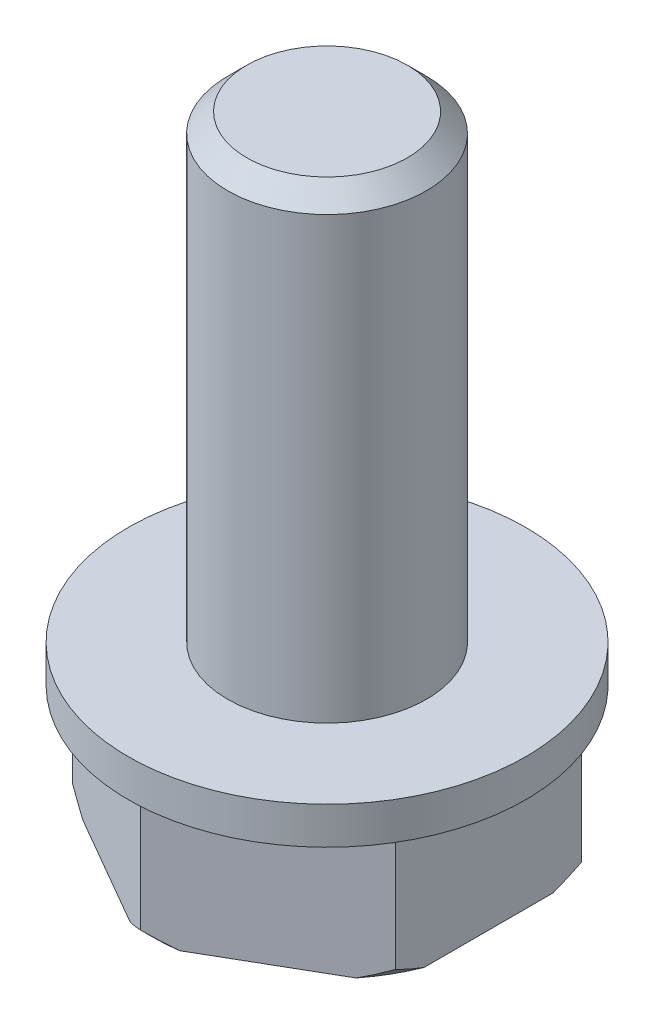
ISO-10303-21;
HEADER;
FILE_DESCRIPTION(('STEP AP214'),'2;1');
FILE_NAME('part.step','',(''),(''),'','','');
FILE_SCHEMA(('AUTOMOTIVE_DESIGN { 1 0 10303 214 1 1 1 1 }'));
ENDSEC;
DATA;
#1=APPLICATION_CONTEXT('core data for automotive mechanical design processes');
#2=APPLICATION_PROTOCOL_DEFINITION('international standard','automotive_design',2000,#1);
#3=PRODUCT_CONTEXT('',#1,'mechanical');
#4=PRODUCT('Part','Part','',(#3));
#5=PRODUCT_RELATED_PRODUCT_CATEGORY('part','',(#4));
#6=PRODUCT_DEFINITION_FORMATION('','',#4);
#7=PRODUCT_DEFINITION_CONTEXT('part definition',#1,'design');
#8=PRODUCT_DEFINITION('design','',#6,#7);
#9=PRODUCT_DEFINITION_SHAPE('','',#8);
#10=(LENGTH_UNIT() NAMED_UNIT(*) SI_UNIT(.MILLI.,.METRE.));
#11=(NAMED_UNIT(*) PLANE_ANGLE_UNIT() SI_UNIT($,.RADIAN.));
#12=(NAMED_UNIT(*) SI_UNIT($,.STERADIAN.) SOLID_ANGLE_UNIT());
#13=UNCERTAINTY_MEASURE_WITH_UNIT(LENGTH_MEASURE(1.E-05),#10,'distance_accuracy_value','');
#14=(GEOMETRIC_REPRESENTATION_CONTEXT(3) GLOBAL_UNCERTAINTY_ASSIGNED_CONTEXT((#13)) GLOBAL_UNIT_ASSIGNED_CONTEXT((#10,
#11,#12)) REPRESENTATION_CONTEXT('',''));
#15=CARTESIAN_POINT('',(0.,0.,0.));
#16=DIRECTION('',(0.,0.,1.));
#17=DIRECTION('',(1.,0.,0.));
#18=AXIS2_PLACEMENT_3D('',#15,#16,#17);
#19=CARTESIAN_POINT('',(31.2487373415292,113.4,-28.5015140912618));
#20=DIRECTION('',(-0.5,0.,0.866025403784439));
#21=DIRECTION('',(0.866025403784439,0.,0.5));
#22=AXIS2_PLACEMENT_3D('',#19,#20,#21);
#23=PLANE('',#22);
#24=DIRECTION('',(0.,-1.,0.));
#25=VECTOR('',#24,1.);
#26=CARTESIAN_POINT('',(31.2487373415292,113.4,-28.5015140912618));
#27=LINE('',#26,#25);
#28=CARTESIAN_POINT('',(31.2487373415292,68.7,-28.5015140912618));
#29=VERTEX_POINT('',#28);
#30=CARTESIAN_POINT('',(31.2487373415292,63.9055534994651,-28.5015140912618));
#31=VERTEX_POINT('',#30);
#32=EDGE_CURVE('E11',#29,#31,#27,.T.);
#33=ORIENTED_EDGE('',*,*,#32,.T.);
#34=CARTESIAN_POINT('',(30.2487373415292,63.4,-29.0788643604513));
#35=CARTESIAN_POINT('',(30.2898871786535,63.4176356350764,-29.0551063342587));
#36=CARTESIAN_POINT('',(30.3309185698522,63.4356367332046,-29.0314154590603));
#37=CARTESIAN_POINT('',(30.4131261080462,63.4725093452912,-28.9839491794677));
#38=CARTESIAN_POINT('',(30.4543000527066,63.491387396993,-28.9601750378369));
#39=CARTESIAN_POINT('',(30.5368134585381,63.5300136187559,-28.9125317923883));
#40=CARTESIAN_POINT('',(30.5781505543364,63.5497685285905,-28.8886640603468));
#41=CARTESIAN_POINT('',(30.6610101371074,63.5901483001101,-28.840822802906));
#42=CARTESIAN_POINT('',(30.7025301099427,63.6107800529027,-28.8168507420988));
#43=CARTESIAN_POINT('',(30.7857742143479,63.6529133663717,-28.7687901149625));
#44=CARTESIAN_POINT('',(30.8274956955541,63.6744219220571,-28.7447030936522));
#45=CARTESIAN_POINT('',(30.9111605932301,63.7183087773034,-28.6964018923307));
#46=CARTESIAN_POINT('',(30.9531012369611,63.7406941334488,-28.6721893240107));
#47=CARTESIAN_POINT('',(31.037221231282,63.7863344571394,-28.6236265656998));
#48=CARTESIAN_POINT('',(31.0793977002766,63.8095965033679,-28.5992780414191));
#49=CARTESIAN_POINT('',(31.164005290327,63.8569905234084,-28.5504330230577));
#50=CARTESIAN_POINT('',(31.2064334361144,63.8811295690813,-28.5259382351502));
#51=CARTESIAN_POINT('',(31.2487373415291,63.9055534994651,-28.5015140912617));
#52=B_SPLINE_CURVE_WITH_KNOTS('',3,(#34,#35,#36,#37,#38,#39,#40,#41,#42,#43,#44,#45,#46,#47,#48,
#49,#50,#51),.UNSPECIFIED.,.F.,.F.,(4,2,2,2,2,2,2,2,4),(0.,0.15204686609259,0.305507708751331,
0.460480357340252,0.617058082843112,0.775329645183761,0.935379361568319,1.0972871929665,
1.26112884592903),.UNSPECIFIED.);
#53=CARTESIAN_POINT('',(30.2487373415292,63.4,-29.0788643604513));
#54=VERTEX_POINT('',#53);
#55=EDGE_CURVE('E418',#54,#31,#52,.T.);
#56=ORIENTED_EDGE('',*,*,#55,.F.);
#57=DIRECTION('',(0.866025403784439,0.,0.5));
#58=VECTOR('',#57,1.);
#59=CARTESIAN_POINT('',(33.2487373415291,63.4,-27.3468135528825));
#60=LINE('',#59,#58);
#61=CARTESIAN_POINT('',(25.7487373415292,63.4,-31.6769405718047));
#62=VERTEX_POINT('',#61);
#63=EDGE_CURVE('E369',#62,#54,#60,.T.);
#64=ORIENTED_EDGE('',*,*,#63,.F.);
#65=CARTESIAN_POINT('',(24.7487373415291,63.9055534994651,-32.2542908409943));
#66=CARTESIAN_POINT('',(24.7910412233096,63.8811295690813,-32.2298666561701));
#67=CARTESIAN_POINT('',(24.8334684047916,63.8569905234084,-32.2053701980365));
#68=CARTESIAN_POINT('',(24.9180732265661,63.8095965033679,-32.1565203848805));
#69=CARTESIAN_POINT('',(24.9602479016351,63.7863344571393,-32.1321687534296));
#70=CARTESIAN_POINT('',(25.0443644811706,63.7406941334488,-32.083600080537));
#71=CARTESIAN_POINT('',(25.0863035022922,63.7183087773034,-32.0593847017748));
#72=CARTESIAN_POINT('',(25.1699660185079,63.674421922057,-32.0110793756431));
#73=CARTESIAN_POINT('',(25.2116867314672,63.6529133663717,-31.9869910236903));
#74=CARTESIAN_POINT('',(25.2949305076916,63.6107800529027,-31.9389298281282));
#75=CARTESIAN_POINT('',(25.3364509077494,63.5901483001101,-31.914958507292));
#76=CARTESIAN_POINT('',(25.4193124434277,63.5497685285904,-31.8671206323857));
#77=CARTESIAN_POINT('',(25.4606510536055,63.5300136187559,-31.8432555233265));
#78=CARTESIAN_POINT('',(25.5431680173984,63.4913873969929,-31.7956184404479));
#79=CARTESIAN_POINT('',(25.584344000334,63.4725093452912,-31.7718478292134));
#80=CARTESIAN_POINT('',(25.6665547733813,63.4356367332046,-31.7243871525511));
#81=CARTESIAN_POINT('',(25.7075873687404,63.4176356350764,-31.7006983630196));
#82=CARTESIAN_POINT('',(25.7487373415291,63.4,-31.6769405718047));
#83=B_SPLINE_CURVE_WITH_KNOTS('',3,(#65,#66,#67,#68,#69,#70,#71,#72,#73,#74,#75,#76,#77,#78,#79,
#80,#81,#82),.UNSPECIFIED.,.F.,.F.,(4,2,2,2,2,2,2,2,4),(0.,0.163841652962564,0.325749484360772,
0.485799200745352,0.644070763085999,0.800648488588859,0.955621137177764,1.10908197983649,
1.26112884592904),.UNSPECIFIED.);
#84=CARTESIAN_POINT('',(24.7487373415292,63.9055534994651,-32.2542908409943));
#85=VERTEX_POINT('',#84);
#86=EDGE_CURVE('E352',#85,#62,#83,.T.);
#87=ORIENTED_EDGE('',*,*,#86,.F.);
#88=DIRECTION('',(0.,-1.,0.));
#89=VECTOR('',#88,1.);
#90=CARTESIAN_POINT('',(24.7487373415292,113.4,-32.2542908409943));
#91=LINE('',#90,#89);
#92=CARTESIAN_POINT('',(24.7487373415292,68.7,-32.2542908409943));
#93=VERTEX_POINT('',#92);
#94=EDGE_CURVE('E355',#93,#85,#91,.T.);
#95=ORIENTED_EDGE('',*,*,#94,.F.);
#96=DIRECTION('',(-0.866025403784439,0.,-0.5));
#97=VECTOR('',#96,1.);
#98=CARTESIAN_POINT('',(30.9987373415292,68.7,-28.6458516585592));
#99=LINE('',#98,#97);
#100=EDGE_CURVE('E408',#29,#93,#99,.T.);
#101=ORIENTED_EDGE('',*,*,#100,.F.);
#102=EDGE_LOOP('',(#33,#56,#64,#87,#95,#101));
#103=FACE_BOUND('',#102,.T.);
#104=ADVANCED_FACE('F16',(#103),#23,.F.);
#105=CARTESIAN_POINT('',(31.2487373415292,113.4,-20.9959605917966));
#106=DIRECTION('',(-1.,0.,0.));
#107=DIRECTION('',(0.,0.,1.));
#108=AXIS2_PLACEMENT_3D('',#105,#106,#107);
#109=PLANE('',#108);
#110=DIRECTION('',(0.,-1.,0.));
#111=VECTOR('',#110,1.);
#112=CARTESIAN_POINT('',(31.2487373415292,113.4,-20.9959605917966));
#113=LINE('',#112,#111);
#114=CARTESIAN_POINT('',(31.2487373415292,68.7,-20.9959605917966));
#115=VERTEX_POINT('',#114);
#116=CARTESIAN_POINT('',(31.2487373415292,63.9055534994651,-20.9959605917966));
#117=VERTEX_POINT('',#116);
#118=EDGE_CURVE('E406',#115,#117,#113,.T.);
#119=ORIENTED_EDGE('',*,*,#118,.T.);
#120=CARTESIAN_POINT('',(31.2487373415291,63.4,-22.1506611301758));
#121=CARTESIAN_POINT('',(31.2487372058647,63.4176356350764,-22.1031453127683));
#122=CARTESIAN_POINT('',(31.2487360017043,63.4356367332046,-22.0557656480384));
#123=CARTESIAN_POINT('',(31.248732766851,63.4725093452911,-21.9608386917835));
#124=CARTESIAN_POINT('',(31.2487307285758,63.4913873969929,-21.9132939389182));
#125=CARTESIAN_POINT('',(31.2487271706144,63.5300136187559,-21.8180136105911));
#126=CARTESIAN_POINT('',(31.2487256562348,63.5497685285904,-21.7702807694904));
#127=CARTESIAN_POINT('',(31.2487237033276,63.5901483001101,-21.6746016371432));
#128=CARTESIAN_POINT('',(31.2487232761051,63.6107800529026,-21.6266582554998));
#129=CARTESIAN_POINT('',(31.2487236042859,63.6529133663716,-21.5305364328015));
#130=CARTESIAN_POINT('',(31.2487243725327,63.674421922057,-21.4823610595383));
#131=CARTESIAN_POINT('',(31.248726753993,63.7183087773034,-21.3857545320851));
#132=CARTESIAN_POINT('',(31.2487283766026,63.7406941334487,-21.3373265850029));
#133=CARTESIAN_POINT('',(31.2487317913879,63.7863344571393,-21.2401951537994));
#134=CARTESIAN_POINT('',(31.2487335853135,63.8095965033679,-21.1914949980678));
#135=CARTESIAN_POINT('',(31.2487363535894,63.8569905234084,-21.0938001665504));
#136=CARTESIAN_POINT('',(31.2487373178949,63.8811295690813,-21.0448089205093));
#137=CARTESIAN_POINT('',(31.2487373415291,63.9055534994651,-20.9959605917966));
#138=B_SPLINE_CURVE_WITH_KNOTS('',3,(#120,#121,#122,#123,#124,#125,#126,#127,#128,#129,#130,
#131,#132,#133,#134,#135,#136,#137),.UNSPECIFIED.,.F.,.F.,(4,2,2,2,2,2,2,2,4),(0.,
0.152046866092544,0.305507708751253,0.460480357340149,0.617058082843008,0.775329645183672,
0.935379361568252,1.09728719296647,1.26112884592905),.UNSPECIFIED.);
#139=CARTESIAN_POINT('',(31.2487373415292,63.4,-22.1506611301759));
#140=VERTEX_POINT('',#139);
#141=EDGE_CURVE('E29',#140,#117,#138,.T.);
#142=ORIENTED_EDGE('',*,*,#141,.F.);
#143=DIRECTION('',(0.,0.,1.));
#144=VECTOR('',#143,1.);
#145=CARTESIAN_POINT('',(31.2487373415292,63.4,-24.7487373415292));
#146=LINE('',#145,#144);
#147=CARTESIAN_POINT('',(31.2487373415292,63.4,-27.3468135528825));
#148=VERTEX_POINT('',#147);
#149=EDGE_CURVE('E445',#148,#140,#146,.T.);
#150=ORIENTED_EDGE('',*,*,#149,.F.);
#151=CARTESIAN_POINT('',(31.2487373415292,63.9055534994651,-28.5015140912618));
#152=CARTESIAN_POINT('',(31.2487373415292,63.7175987189877,-28.125604530307));
#153=CARTESIAN_POINT('',(31.2487373415292,63.5456736196058,-27.7393021691841));
#154=CARTESIAN_POINT('',(31.2487373415292,63.4,-27.3468135528825));
#155=(BOUNDED_CURVE() B_SPLINE_CURVE(3,(#151,#152,#153,#154),.UNSPECIFIED.,.F.,
.F.) B_SPLINE_CURVE_WITH_KNOTS((4,4),(0.00544471025563386,0.00669711306648936),
.UNSPECIFIED.) CURVE() GEOMETRIC_REPRESENTATION_ITEM() RATIONAL_B_SPLINE_CURVE((1.,1.,1.,1.)) REPRESENTATION_ITEM(''));
#156=EDGE_CURVE('E432',#31,#148,#155,.T.);
#157=ORIENTED_EDGE('',*,*,#156,.F.);
#158=ORIENTED_EDGE('',*,*,#32,.F.);
#159=DIRECTION('',(0.,0.,-1.));
#160=VECTOR('',#159,1.);
#161=CARTESIAN_POINT('',(31.2487373415292,68.7,-24.7487373415292));
#162=LINE('',#161,#160);
#163=EDGE_CURVE('E399',#115,#29,#162,.T.);
#164=ORIENTED_EDGE('',*,*,#163,.F.);
#165=EDGE_LOOP('',(#119,#142,#150,#157,#158,#164));
#166=FACE_BOUND('',#165,.T.);
#167=ADVANCED_FACE('F248',(#166),#109,.F.);
#168=CARTESIAN_POINT('',(24.7487373415292,64.2,-24.7487373415292));
#169=DIRECTION('',(0.,1.,0.));
#170=DIRECTION('',(0.,0.,1.));
#171=AXIS2_PLACEMENT_3D('',#168,#169,#170);
#172=CONICAL_SURFACE('',#171,7.8,0.785398163397448);
#173=CARTESIAN_POINT('',(24.7487373415292,63.4,-24.7487373415292));
#174=DIRECTION('',(0.,-1.,0.));
#175=DIRECTION('',(0.,0.,-1.));
#176=AXIS2_PLACEMENT_3D('',#173,#174,#175);
#177=CIRCLE('',#176,7.);
#178=CARTESIAN_POINT('',(30.2487373415292,63.4,-20.4186103226069));
#179=VERTEX_POINT('',#178);
#180=EDGE_CURVE('E131',#140,#179,#177,.T.);
#181=ORIENTED_EDGE('',*,*,#180,.F.);
#182=ORIENTED_EDGE('',*,*,#141,.T.);
#183=CARTESIAN_POINT('',(31.2487373415291,63.9055534994651,-20.9959605917966));
#184=CARTESIAN_POINT('',(31.2064334361144,63.8811295690813,-20.9715364479081));
#185=CARTESIAN_POINT('',(31.164005290327,63.8569905234084,-20.9470416600005));
#186=CARTESIAN_POINT('',(31.0793977002765,63.8095965033679,-20.8981966416391));
#187=CARTESIAN_POINT('',(31.0372212312819,63.7863344571393,-20.8738481173585));
#188=CARTESIAN_POINT('',(30.9531012369611,63.7406941334488,-20.8252853590476));
#189=CARTESIAN_POINT('',(30.91116059323,63.7183087773034,-20.8010727907276));
#190=CARTESIAN_POINT('',(30.827495695554,63.674421922057,-20.7527715894061));
#191=CARTESIAN_POINT('',(30.7857742143479,63.6529133663717,-20.7286845680957));
#192=CARTESIAN_POINT('',(30.7025301099427,63.6107800529026,-20.6806239409595));
#193=CARTESIAN_POINT('',(30.6610101371074,63.5901483001101,-20.6566518801522));
#194=CARTESIAN_POINT('',(30.5781505543363,63.5497685285904,-20.6088106227114));
#195=CARTESIAN_POINT('',(30.5368134585381,63.5300136187559,-20.5849428906699));
#196=CARTESIAN_POINT('',(30.4543000527066,63.4913873969929,-20.5372996452214));
#197=CARTESIAN_POINT('',(30.4131261080462,63.4725093452911,-20.5135255035906));
#198=CARTESIAN_POINT('',(30.3309185698522,63.4356367332046,-20.466059223998));
#199=CARTESIAN_POINT('',(30.2898871786534,63.4176356350764,-20.4423683487996));
#200=CARTESIAN_POINT('',(30.2487373415291,63.4,-20.418610322607));
#201=B_SPLINE_CURVE_WITH_KNOTS('',3,(#183,#184,#185,#186,#187,#188,#189,#190,#191,#192,#193,
#194,#195,#196,#197,#198,#199,#200),.UNSPECIFIED.,.F.,.F.,(4,2,2,2,2,2,2,2,4),(0.,
0.163841652962562,0.32574948436077,0.485799200745342,0.644070763086002,0.800648488588857,
0.955621137177764,1.10908197983648,1.26112884592903),.UNSPECIFIED.);
#202=EDGE_CURVE('E142',#117,#179,#201,.T.);
#203=ORIENTED_EDGE('',*,*,#202,.T.);
#204=EDGE_LOOP('',(#181,#182,#203));
#205=FACE_BOUND('',#204,.T.);
#206=ADVANCED_FACE('F237',(#205),#172,.T.);
#207=CARTESIAN_POINT('',(24.7487373415292,64.2,-24.7487373415292));
#208=DIRECTION('',(0.,1.,0.));
#209=DIRECTION('',(0.,0.,1.));
#210=AXIS2_PLACEMENT_3D('',#207,#208,#209);
#211=CONICAL_SURFACE('',#210,7.8,0.785398163397448);
#212=CARTESIAN_POINT('',(24.7487373415292,63.4,-24.7487373415292));
#213=DIRECTION('',(0.,-1.,0.));
#214=DIRECTION('',(0.,0.,-1.));
#215=AXIS2_PLACEMENT_3D('',#212,#213,#214);
#216=CIRCLE('',#215,7.);
#217=EDGE_CURVE('E372',#54,#148,#216,.T.);
#218=ORIENTED_EDGE('',*,*,#217,.F.);
#219=ORIENTED_EDGE('',*,*,#55,.T.);
#220=ORIENTED_EDGE('',*,*,#156,.T.);
#221=EDGE_LOOP('',(#218,#219,#220));
#222=FACE_BOUND('',#221,.T.);
#223=ADVANCED_FACE('F247',(#222),#211,.T.);
#224=CARTESIAN_POINT('',(24.7487373415292,64.2,-24.7487373415292));
#225=DIRECTION('',(0.,1.,0.));
#226=DIRECTION('',(0.,0.,1.));
#227=AXIS2_PLACEMENT_3D('',#224,#225,#226);
#228=CONICAL_SURFACE('',#227,7.8,0.785398163397448);
#229=CARTESIAN_POINT('',(24.7487373415292,63.4,-24.7487373415292));
#230=DIRECTION('',(0.,-1.,0.));
#231=DIRECTION('',(0.,0.,-1.));
#232=AXIS2_PLACEMENT_3D('',#229,#230,#231);
#233=CIRCLE('',#232,7.);
#234=CARTESIAN_POINT('',(23.7487373415292,63.4,-31.6769405718047));
#235=VERTEX_POINT('',#234);
#236=EDGE_CURVE('E367',#235,#62,#233,.T.);
#237=ORIENTED_EDGE('',*,*,#236,.F.);
#238=CARTESIAN_POINT('',(23.7487373415291,63.4,-31.6769405718047));
#239=CARTESIAN_POINT('',(23.7898873143179,63.4176356350764,-31.7006983630196));
#240=CARTESIAN_POINT('',(23.830919909677,63.4356367332046,-31.7243871525511));
#241=CARTESIAN_POINT('',(23.9131306827243,63.4725093452912,-31.7718478292134));
#242=CARTESIAN_POINT('',(23.9543066656599,63.4913873969929,-31.7956184404479));
#243=CARTESIAN_POINT('',(24.0368236294529,63.5300136187559,-31.8432555233265));
#244=CARTESIAN_POINT('',(24.0781622396307,63.5497685285904,-31.8671206323857));
#245=CARTESIAN_POINT('',(24.1610237753089,63.5901483001101,-31.914958507292));
#246=CARTESIAN_POINT('',(24.2025441753667,63.6107800529027,-31.9389298281282));
#247=CARTESIAN_POINT('',(24.2857879515911,63.6529133663717,-31.9869910236903));
#248=CARTESIAN_POINT('',(24.3275086645504,63.6744219220571,-32.0110793756431));
#249=CARTESIAN_POINT('',(24.4111711807662,63.7183087773034,-32.0593847017748));
#250=CARTESIAN_POINT('',(24.4531102018877,63.7406941334488,-32.083600080537));
#251=CARTESIAN_POINT('',(24.5372267814232,63.7863344571393,-32.1321687534296));
#252=CARTESIAN_POINT('',(24.5794014564922,63.8095965033679,-32.1565203848805));
#253=CARTESIAN_POINT('',(24.6640062782667,63.8569905234084,-32.2053701980365));
#254=CARTESIAN_POINT('',(24.7064334597487,63.8811295690813,-32.2298666561701));
#255=CARTESIAN_POINT('',(24.7487373415292,63.9055534994651,-32.2542908409943));
#256=B_SPLINE_CURVE_WITH_KNOTS('',3,(#238,#239,#240,#241,#242,#243,#244,#245,#246,#247,#248,
#249,#250,#251,#252,#253,#254,#255),.UNSPECIFIED.,.F.,.F.,(4,2,2,2,2,2,2,2,4),(0.,
0.152046866092578,0.305507708751304,0.460480357340222,0.617058082843082,0.77532964518374,
0.935379361568303,1.09728719296651,1.26112884592906),.UNSPECIFIED.);
#257=EDGE_CURVE('E351',#235,#85,#256,.T.);
#258=ORIENTED_EDGE('',*,*,#257,.T.);
#259=ORIENTED_EDGE('',*,*,#86,.T.);
#260=EDGE_LOOP('',(#237,#258,#259));
#261=FACE_BOUND('',#260,.T.);
#262=ADVANCED_FACE('F327',(#261),#228,.T.);
#263=CARTESIAN_POINT('',(24.7487373415292,70.2,-24.7487373415292));
#264=DIRECTION('',(0.,-1.,0.));
#265=DIRECTION('',(0.,0.,-1.));
#266=AXIS2_PLACEMENT_3D('',#263,#264,#265);
#267=PLANE('',#266);
#268=CARTESIAN_POINT('',(24.7487373415292,70.2,-24.7487373415292));
#269=DIRECTION('',(0.,-1.,0.));
#270=DIRECTION('',(0.,0.,-1.));
#271=AXIS2_PLACEMENT_3D('',#268,#269,#270);
#272=CIRCLE('',#271,4.);
#273=CARTESIAN_POINT('',(24.7487373415292,70.2,-28.7487373415292));
#274=VERTEX_POINT('',#273);
#275=EDGE_CURVE('E215',#274,#274,#272,.T.);
#276=ORIENTED_EDGE('',*,*,#275,.T.);
#277=EDGE_LOOP('',(#276));
#278=FACE_BOUND('',#277,.T.);
#279=CARTESIAN_POINT('',(24.7487373415292,70.2,-24.7487373415292));
#280=DIRECTION('',(0.,-1.,0.));
#281=DIRECTION('',(0.,0.,-1.));
#282=AXIS2_PLACEMENT_3D('',#279,#280,#281);
#283=CIRCLE('',#282,8.);
#284=CARTESIAN_POINT('',(24.7487373415292,70.2,-32.7487373415291));
#285=VERTEX_POINT('',#284);
#286=EDGE_CURVE('E350',#285,#285,#283,.T.);
#287=ORIENTED_EDGE('',*,*,#286,.F.);
#288=EDGE_LOOP('',(#287));
#289=FACE_BOUND('',#288,.T.);
#290=ADVANCED_FACE('F249',(#278,#289),#267,.F.);
#291=CARTESIAN_POINT('',(24.7487373415292,64.2,-24.7487373415292));
#292=DIRECTION('',(0.,1.,0.));
#293=DIRECTION('',(0.,0.,1.));
#294=AXIS2_PLACEMENT_3D('',#291,#292,#293);
#295=CONICAL_SURFACE('',#294,7.8,0.785398163397448);
#296=CARTESIAN_POINT('',(24.7487373415292,63.4,-24.7487373415292));
#297=DIRECTION('',(0.,-1.,0.));
#298=DIRECTION('',(0.,0.,-1.));
#299=AXIS2_PLACEMENT_3D('',#296,#297,#298);
#300=CIRCLE('',#299,7.);
#301=CARTESIAN_POINT('',(18.2487373415292,63.4,-27.3468135528825));
#302=VERTEX_POINT('',#301);
#303=CARTESIAN_POINT('',(19.2487373415291,63.4,-29.0788643604513));
#304=VERTEX_POINT('',#303);
#305=EDGE_CURVE('E374',#302,#304,#300,.T.);
#306=ORIENTED_EDGE('',*,*,#305,.F.);
#307=CARTESIAN_POINT('',(18.2487373415292,63.4,-27.3468135528825));
#308=CARTESIAN_POINT('',(18.2487374771936,63.4176356350764,-27.39432937029));
#309=CARTESIAN_POINT('',(18.248738681354,63.4356367332046,-27.4417090350199));
#310=CARTESIAN_POINT('',(18.2487419162073,63.4725093452912,-27.5366359912749));
#311=CARTESIAN_POINT('',(18.2487439544825,63.4913873969929,-27.5841807441401));
#312=CARTESIAN_POINT('',(18.2487475124439,63.5300136187559,-27.6794610724672));
#313=CARTESIAN_POINT('',(18.2487490268234,63.5497685285904,-27.727193913568));
#314=CARTESIAN_POINT('',(18.2487509797307,63.5901483001101,-27.8228730459151));
#315=CARTESIAN_POINT('',(18.2487514069532,63.6107800529027,-27.8708164275585));
#316=CARTESIAN_POINT('',(18.2487510787723,63.6529133663717,-27.9669382502568));
#317=CARTESIAN_POINT('',(18.2487503105256,63.674421922057,-28.01511362352));
#318=CARTESIAN_POINT('',(18.2487479290653,63.7183087773034,-28.1117201509732));
#319=CARTESIAN_POINT('',(18.2487463064557,63.7406941334488,-28.1601480980554));
#320=CARTESIAN_POINT('',(18.2487428916704,63.7863344571394,-28.2572795292589));
#321=CARTESIAN_POINT('',(18.2487410977448,63.8095965033679,-28.3059796849905));
#322=CARTESIAN_POINT('',(18.2487383294689,63.8569905234084,-28.4036745165079));
#323=CARTESIAN_POINT('',(18.2487373651634,63.8811295690813,-28.452665762549));
#324=CARTESIAN_POINT('',(18.2487373415292,63.9055534994651,-28.5015140912617));
#325=B_SPLINE_CURVE_WITH_KNOTS('',3,(#307,#308,#309,#310,#311,#312,#313,#314,#315,#316,#317,
#318,#319,#320,#321,#322,#323,#324),.UNSPECIFIED.,.F.,.F.,(4,2,2,2,2,2,2,2,4),(0.,
0.152046866092554,0.305507708751278,0.460480357340183,0.617058082843039,0.775329645183694,
0.935379361568264,1.09728719296648,1.26112884592904),.UNSPECIFIED.);
#326=CARTESIAN_POINT('',(18.2487373415292,63.9055534994651,-28.5015140912618));
#327=VERTEX_POINT('',#326);
#328=EDGE_CURVE('E312',#302,#327,#325,.T.);
#329=ORIENTED_EDGE('',*,*,#328,.T.);
#330=CARTESIAN_POINT('',(18.2487373415292,63.9055534994651,-28.5015140912617));
#331=CARTESIAN_POINT('',(18.2910412469439,63.8811295690813,-28.5259382351502));
#332=CARTESIAN_POINT('',(18.3334693927313,63.8569905234084,-28.5504330230578));
#333=CARTESIAN_POINT('',(18.4180769827818,63.8095965033679,-28.5992780414192));
#334=CARTESIAN_POINT('',(18.4602534517764,63.7863344571393,-28.6236265656998));
#335=CARTESIAN_POINT('',(18.5443734460972,63.7406941334488,-28.6721893240108));
#336=CARTESIAN_POINT('',(18.5863140898283,63.7183087773034,-28.6964018923307));
#337=CARTESIAN_POINT('',(18.6699789875043,63.674421922057,-28.7447030936522));
#338=CARTESIAN_POINT('',(18.7117004687104,63.6529133663717,-28.7687901149626));
#339=CARTESIAN_POINT('',(18.7949445731156,63.6107800529026,-28.8168507420988));
#340=CARTESIAN_POINT('',(18.8364645459509,63.5901483001101,-28.8408228029061));
#341=CARTESIAN_POINT('',(18.919324128722,63.5497685285904,-28.8886640603469));
#342=CARTESIAN_POINT('',(18.9606612245203,63.5300136187559,-28.9125317923884));
#343=CARTESIAN_POINT('',(19.0431746303517,63.4913873969929,-28.9601750378369));
#344=CARTESIAN_POINT('',(19.0843485750121,63.4725093452911,-28.9839491794677));
#345=CARTESIAN_POINT('',(19.1665561132061,63.4356367332046,-29.0314154590603));
#346=CARTESIAN_POINT('',(19.2075875044049,63.4176356350764,-29.0551063342587));
#347=CARTESIAN_POINT('',(19.2487373415292,63.4,-29.0788643604513));
#348=B_SPLINE_CURVE_WITH_KNOTS('',3,(#330,#331,#332,#333,#334,#335,#336,#337,#338,#339,#340,
#341,#342,#343,#344,#345,#346,#347),.UNSPECIFIED.,.F.,.F.,(4,2,2,2,2,2,2,2,4),(0.,
0.163841652962561,0.325749484360773,0.485799200745347,0.644070763086004,0.80064848858886,
0.955621137177767,1.10908197983648,1.26112884592904),.UNSPECIFIED.);
#349=EDGE_CURVE('E342',#327,#304,#348,.T.);
#350=ORIENTED_EDGE('',*,*,#349,.T.);
#351=EDGE_LOOP('',(#306,#329,#350));
#352=FACE_BOUND('',#351,.T.);
#353=ADVANCED_FACE('F318',(#352),#295,.T.);
#354=CARTESIAN_POINT('',(24.7487373415292,68.7,-24.7487373415292));
#355=DIRECTION('',(0.,-1.,0.));
#356=DIRECTION('',(0.,0.,-1.));
#357=AXIS2_PLACEMENT_3D('',#354,#355,#356);
#358=CYLINDRICAL_SURFACE('',#357,8.);
#359=ORIENTED_EDGE('',*,*,#286,.T.);
#360=EDGE_LOOP('',(#359));
#361=FACE_BOUND('',#360,.T.);
#362=CARTESIAN_POINT('',(24.7487373415292,68.7,-24.7487373415292));
#363=DIRECTION('',(0.,-1.,0.));
#364=DIRECTION('',(0.,0.,-1.));
#365=AXIS2_PLACEMENT_3D('',#362,#363,#364);
#366=CIRCLE('',#365,8.);
#367=CARTESIAN_POINT('',(24.7487373415292,68.7,-32.7487373415291));
#368=VERTEX_POINT('',#367);
#369=EDGE_CURVE('E390',#368,#368,#366,.T.);
#370=ORIENTED_EDGE('',*,*,#369,.F.);
#371=EDGE_LOOP('',(#370));
#372=FACE_BOUND('',#371,.T.);
#373=ADVANCED_FACE('F288',(#361,#372),#358,.T.);
#374=CARTESIAN_POINT('',(24.7487373415292,113.4,-32.2542908409943));
#375=DIRECTION('',(0.5,0.,0.866025403784439));
#376=DIRECTION('',(0.866025403784439,0.,-0.5));
#377=AXIS2_PLACEMENT_3D('',#374,#375,#376);
#378=PLANE('',#377);
#379=ORIENTED_EDGE('',*,*,#94,.T.);
#380=ORIENTED_EDGE('',*,*,#257,.F.);
#381=DIRECTION('',(0.866025403784439,0.,-0.5));
#382=VECTOR('',#381,1.);
#383=CARTESIAN_POINT('',(26.7487373415292,63.4,-33.4089913793736));
#384=LINE('',#383,#382);
#385=EDGE_CURVE('E348',#304,#235,#384,.T.);
#386=ORIENTED_EDGE('',*,*,#385,.F.);
#387=ORIENTED_EDGE('',*,*,#349,.F.);
#388=DIRECTION('',(0.,-1.,0.));
#389=VECTOR('',#388,1.);
#390=CARTESIAN_POINT('',(18.2487373415292,113.4,-28.5015140912618));
#391=LINE('',#390,#389);
#392=CARTESIAN_POINT('',(18.2487373415292,68.7,-28.5015140912618));
#393=VERTEX_POINT('',#392);
#394=EDGE_CURVE('E345',#393,#327,#391,.T.);
#395=ORIENTED_EDGE('',*,*,#394,.F.);
#396=DIRECTION('',(-0.866025403784439,0.,0.5));
#397=VECTOR('',#396,1.);
#398=CARTESIAN_POINT('',(24.4987373415292,68.7,-32.1099532736969));
#399=LINE('',#398,#397);
#400=EDGE_CURVE('E396',#93,#393,#399,.T.);
#401=ORIENTED_EDGE('',*,*,#400,.F.);
#402=EDGE_LOOP('',(#379,#380,#386,#387,#395,#401));
#403=FACE_BOUND('',#402,.T.);
#404=ADVANCED_FACE('F284',(#403),#378,.F.);
#405=CARTESIAN_POINT('',(18.2487373415292,113.4,-28.5015140912618));
#406=DIRECTION('',(1.,0.,0.));
#407=DIRECTION('',(0.,0.,-1.));
#408=AXIS2_PLACEMENT_3D('',#405,#406,#407);
#409=PLANE('',#408);
#410=ORIENTED_EDGE('',*,*,#394,.T.);
#411=ORIENTED_EDGE('',*,*,#328,.F.);
#412=DIRECTION('',(0.,0.,-1.));
#413=VECTOR('',#412,1.);
#414=CARTESIAN_POINT('',(18.2487373415292,63.4,-24.7487373415292));
#415=LINE('',#414,#413);
#416=CARTESIAN_POINT('',(18.2487373415292,63.4,-22.1506611301759));
#417=VERTEX_POINT('',#416);
#418=EDGE_CURVE('E210',#417,#302,#415,.T.);
#419=ORIENTED_EDGE('',*,*,#418,.F.);
#420=CARTESIAN_POINT('',(18.2487373415292,63.9055534994651,-20.9959605917966));
#421=CARTESIAN_POINT('',(18.2487373415292,63.7175987189877,-21.3718701527514));
#422=CARTESIAN_POINT('',(18.2487373415292,63.5456736196058,-21.7581725138741));
#423=CARTESIAN_POINT('',(18.2487373415292,63.4,-22.1506611301759));
#424=(BOUNDED_CURVE() B_SPLINE_CURVE(3,(#420,#421,#422,#423),.UNSPECIFIED.,.F.,
.F.) B_SPLINE_CURVE_WITH_KNOTS((4,4),(0.00544471025563386,0.00669711306648936),
.UNSPECIFIED.) CURVE() GEOMETRIC_REPRESENTATION_ITEM() RATIONAL_B_SPLINE_CURVE((1.,1.,1.,1.)) REPRESENTATION_ITEM(''));
#425=CARTESIAN_POINT('',(18.2487373415292,63.9055534994651,-20.9959605917966));
#426=VERTEX_POINT('',#425);
#427=EDGE_CURVE('E130',#426,#417,#424,.T.);
#428=ORIENTED_EDGE('',*,*,#427,.F.);
#429=DIRECTION('',(0.,-1.,0.));
#430=VECTOR('',#429,1.);
#431=CARTESIAN_POINT('',(18.2487373415292,113.4,-20.9959605917966));
#432=LINE('',#431,#430);
#433=CARTESIAN_POINT('',(18.2487373415292,68.7,-20.9959605917966));
#434=VERTEX_POINT('',#433);
#435=EDGE_CURVE('E220',#434,#426,#432,.T.);
#436=ORIENTED_EDGE('',*,*,#435,.F.);
#437=DIRECTION('',(0.,0.,1.));
#438=VECTOR('',#437,1.);
#439=CARTESIAN_POINT('',(18.2487373415292,68.7,-24.7487373415292));
#440=LINE('',#439,#438);
#441=EDGE_CURVE('E392',#393,#434,#440,.T.);
#442=ORIENTED_EDGE('',*,*,#441,.F.);
#443=EDGE_LOOP('',(#410,#411,#419,#428,#436,#442));
#444=FACE_BOUND('',#443,.T.);
#445=ADVANCED_FACE('F18',(#444),#409,.F.);
#446=CARTESIAN_POINT('',(32.7487373415291,68.7,-24.7487373415292));
#447=DIRECTION('',(0.,1.,0.));
#448=DIRECTION('',(0.,0.,1.));
#449=AXIS2_PLACEMENT_3D('',#446,#447,#448);
#450=PLANE('',#449);
#451=ORIENTED_EDGE('',*,*,#369,.T.);
#452=EDGE_LOOP('',(#451));
#453=FACE_BOUND('',#452,.T.);
#454=ORIENTED_EDGE('',*,*,#163,.T.);
#455=ORIENTED_EDGE('',*,*,#100,.T.);
#456=ORIENTED_EDGE('',*,*,#400,.T.);
#457=ORIENTED_EDGE('',*,*,#441,.T.);
#458=DIRECTION('',(0.866025403784439,0.,0.5));
#459=VECTOR('',#458,1.);
#460=CARTESIAN_POINT('',(24.4987373415292,68.7,-17.3875214093615));
#461=LINE('',#460,#459);
#462=CARTESIAN_POINT('',(24.7487373415292,68.7,-17.243183842064));
#463=VERTEX_POINT('',#462);
#464=EDGE_CURVE('E211',#434,#463,#461,.T.);
#465=ORIENTED_EDGE('',*,*,#464,.T.);
#466=DIRECTION('',(0.866025403784439,0.,-0.5));
#467=VECTOR('',#466,1.);
#468=CARTESIAN_POINT('',(30.9987373415292,68.7,-20.8516230244992));
#469=LINE('',#468,#467);
#470=EDGE_CURVE('E227',#463,#115,#469,.T.);
#471=ORIENTED_EDGE('',*,*,#470,.T.);
#472=EDGE_LOOP('',(#454,#455,#456,#457,#465,#471));
#473=FACE_BOUND('',#472,.T.);
#474=ADVANCED_FACE('F282',(#453,#473),#450,.F.);
#475=CARTESIAN_POINT('',(24.7487373415292,88.7,-24.7487373415292));
#476=DIRECTION('',(0.,-1.,0.));
#477=DIRECTION('',(0.,0.,-1.));
#478=AXIS2_PLACEMENT_3D('',#475,#476,#477);
#479=CONICAL_SURFACE('',#478,3.233,0.78539816339745);
#480=CARTESIAN_POINT('',(24.7487373415292,88.7,-24.7487373415292));
#481=DIRECTION('',(0.,-1.,0.));
#482=DIRECTION('',(0.,0.,-1.));
#483=AXIS2_PLACEMENT_3D('',#480,#481,#482);
#484=CIRCLE('',#483,3.233);
#485=CARTESIAN_POINT('',(24.7487373415292,88.7,-27.9817373415292));
#486=VERTEX_POINT('',#485);
#487=EDGE_CURVE('E403',#486,#486,#484,.T.);
#488=ORIENTED_EDGE('',*,*,#487,.T.);
#489=EDGE_LOOP('',(#488));
#490=FACE_BOUND('',#489,.T.);
#491=CARTESIAN_POINT('',(24.7487373415292,87.933,-24.7487373415292));
#492=DIRECTION('',(0.,-1.,0.));
#493=DIRECTION('',(0.,0.,-1.));
#494=AXIS2_PLACEMENT_3D('',#491,#492,#493);
#495=CIRCLE('',#494,4.);
#496=CARTESIAN_POINT('',(24.7487373415292,87.933,-28.7487373415292));
#497=VERTEX_POINT('',#496);
#498=EDGE_CURVE('E401',#497,#497,#495,.T.);
#499=ORIENTED_EDGE('',*,*,#498,.F.);
#500=EDGE_LOOP('',(#499));
#501=FACE_BOUND('',#500,.T.);
#502=ADVANCED_FACE('F279',(#490,#501),#479,.T.);
#503=CARTESIAN_POINT('',(24.7487373415292,88.7,-24.7487373415292));
#504=DIRECTION('',(0.,-1.,0.));
#505=DIRECTION('',(0.,0.,-1.));
#506=AXIS2_PLACEMENT_3D('',#503,#504,#505);
#507=PLANE('',#506);
#508=ORIENTED_EDGE('',*,*,#487,.F.);
#509=EDGE_LOOP('',(#508));
#510=FACE_BOUND('',#509,.T.);
#511=ADVANCED_FACE('F163',(#510),#507,.F.);
#512=CARTESIAN_POINT('',(24.7487373415292,63.4,-24.7487373415292));
#513=DIRECTION('',(0.,-1.,0.));
#514=DIRECTION('',(0.,0.,-1.));
#515=AXIS2_PLACEMENT_3D('',#512,#513,#514);
#516=CYLINDRICAL_SURFACE('',#515,4.);
#517=ORIENTED_EDGE('',*,*,#498,.T.);
#518=EDGE_LOOP('',(#517));
#519=FACE_BOUND('',#518,.T.);
#520=ORIENTED_EDGE('',*,*,#275,.F.);
#521=EDGE_LOOP('',(#520));
#522=FACE_BOUND('',#521,.T.);
#523=ADVANCED_FACE('F162',(#519,#522),#516,.T.);
#524=CARTESIAN_POINT('',(24.7487373415292,64.2,-24.7487373415292));
#525=DIRECTION('',(0.,1.,0.));
#526=DIRECTION('',(0.,0.,1.));
#527=AXIS2_PLACEMENT_3D('',#524,#525,#526);
#528=CONICAL_SURFACE('',#527,7.8,0.785398163397448);
#529=CARTESIAN_POINT('',(24.7487373415292,63.4,-24.7487373415292));
#530=DIRECTION('',(0.,-1.,0.));
#531=DIRECTION('',(0.,0.,-1.));
#532=AXIS2_PLACEMENT_3D('',#529,#530,#531);
#533=CIRCLE('',#532,7.);
#534=CARTESIAN_POINT('',(25.7487373415292,63.4,-17.8205341112537));
#535=VERTEX_POINT('',#534);
#536=CARTESIAN_POINT('',(23.7487373415292,63.4,-17.8205341112537));
#537=VERTEX_POINT('',#536);
#538=EDGE_CURVE('E118',#535,#537,#533,.T.);
#539=ORIENTED_EDGE('',*,*,#538,.F.);
#540=CARTESIAN_POINT('',(25.7487373415292,63.4,-17.8205341112537));
#541=CARTESIAN_POINT('',(25.7075873687404,63.4176356350764,-17.7967763200387));
#542=CARTESIAN_POINT('',(25.6665547733813,63.4356367332046,-17.7730875305072));
#543=CARTESIAN_POINT('',(25.5843440003339,63.4725093452912,-17.7256268538449));
#544=CARTESIAN_POINT('',(25.5431680173983,63.4913873969929,-17.7018562426104));
#545=CARTESIAN_POINT('',(25.4606510536054,63.5300136187559,-17.6542191597318));
#546=CARTESIAN_POINT('',(25.4193124434276,63.5497685285904,-17.6303540506726));
#547=CARTESIAN_POINT('',(25.3364509077494,63.5901483001101,-17.5825161757663));
#548=CARTESIAN_POINT('',(25.2949305076916,63.6107800529027,-17.5585448549301));
#549=CARTESIAN_POINT('',(25.2116867314672,63.6529133663717,-17.510483659368));
#550=CARTESIAN_POINT('',(25.1699660185079,63.6744219220571,-17.4863953074152));
#551=CARTESIAN_POINT('',(25.0863035022921,63.7183087773034,-17.4380899812835));
#552=CARTESIAN_POINT('',(25.0443644811706,63.7406941334488,-17.4138746025213));
#553=CARTESIAN_POINT('',(24.9602479016351,63.7863344571393,-17.3653059296288));
#554=CARTESIAN_POINT('',(24.9180732265661,63.8095965033679,-17.3409542981778));
#555=CARTESIAN_POINT('',(24.8334684047916,63.8569905234084,-17.2921044850218));
#556=CARTESIAN_POINT('',(24.7910412233097,63.8811295690813,-17.2676080268882));
#557=CARTESIAN_POINT('',(24.7487373415292,63.9055534994651,-17.243183842064));
#558=B_SPLINE_CURVE_WITH_KNOTS('',3,(#540,#541,#542,#543,#544,#545,#546,#547,#548,#549,#550,
#551,#552,#553,#554,#555,#556,#557),.UNSPECIFIED.,.F.,.F.,(4,2,2,2,2,2,2,2,4),(0.,
0.15204686609258,0.305507708751306,0.460480357340223,0.617058082843076,0.775329645183734,
0.935379361568294,1.09728719296649,1.26112884592903),.UNSPECIFIED.);
#559=CARTESIAN_POINT('',(24.7487373415292,63.9055534994651,-17.243183842064));
#560=VERTEX_POINT('',#559);
#561=EDGE_CURVE('E122',#535,#560,#558,.T.);
#562=ORIENTED_EDGE('',*,*,#561,.T.);
#563=CARTESIAN_POINT('',(24.7487373415292,63.9055534994651,-17.243183842064));
#564=CARTESIAN_POINT('',(24.7064334597487,63.8811295690813,-17.2676080268882));
#565=CARTESIAN_POINT('',(24.6640062782667,63.8569905234084,-17.2921044850218));
#566=CARTESIAN_POINT('',(24.5794014564922,63.8095965033679,-17.3409542981778));
#567=CARTESIAN_POINT('',(24.5372267814232,63.7863344571393,-17.3653059296288));
#568=CARTESIAN_POINT('',(24.4531102018877,63.7406941334488,-17.4138746025213));
#569=CARTESIAN_POINT('',(24.4111711807662,63.7183087773034,-17.4380899812835));
#570=CARTESIAN_POINT('',(24.3275086645504,63.674421922057,-17.4863953074152));
#571=CARTESIAN_POINT('',(24.2857879515911,63.6529133663717,-17.5104836593681));
#572=CARTESIAN_POINT('',(24.2025441753667,63.6107800529027,-17.5585448549301));
#573=CARTESIAN_POINT('',(24.1610237753089,63.5901483001101,-17.5825161757663));
#574=CARTESIAN_POINT('',(24.0781622396306,63.5497685285904,-17.6303540506726));
#575=CARTESIAN_POINT('',(24.0368236294528,63.5300136187559,-17.6542191597318));
#576=CARTESIAN_POINT('',(23.9543066656599,63.4913873969929,-17.7018562426104));
#577=CARTESIAN_POINT('',(23.9131306827243,63.4725093452912,-17.7256268538449));
#578=CARTESIAN_POINT('',(23.830919909677,63.4356367332046,-17.7730875305072));
#579=CARTESIAN_POINT('',(23.7898873143179,63.4176356350764,-17.7967763200387));
#580=CARTESIAN_POINT('',(23.7487373415291,63.4,-17.8205341112537));
#581=B_SPLINE_CURVE_WITH_KNOTS('',3,(#563,#564,#565,#566,#567,#568,#569,#570,#571,#572,#573,
#574,#575,#576,#577,#578,#579,#580),.UNSPECIFIED.,.F.,.F.,(4,2,2,2,2,2,2,2,4),(0.,
0.163841652962567,0.325749484360774,0.485799200745352,0.644070763086016,0.800648488588872,
0.955621137177786,1.10908197983651,1.26112884592907),.UNSPECIFIED.);
#582=EDGE_CURVE('E125',#560,#537,#581,.T.);
#583=ORIENTED_EDGE('',*,*,#582,.T.);
#584=EDGE_LOOP('',(#539,#562,#583));
#585=FACE_BOUND('',#584,.T.);
#586=ADVANCED_FACE('F120',(#585),#528,.T.);
#587=CARTESIAN_POINT('',(24.7487373415292,64.2,-24.7487373415292));
#588=DIRECTION('',(0.,1.,0.));
#589=DIRECTION('',(0.,0.,1.));
#590=AXIS2_PLACEMENT_3D('',#587,#588,#589);
#591=CONICAL_SURFACE('',#590,7.8,0.785398163397448);
#592=CARTESIAN_POINT('',(19.2487373415292,63.4,-20.4186103226069));
#593=CARTESIAN_POINT('',(19.2075875044049,63.4176356350764,-20.4423683487996));
#594=CARTESIAN_POINT('',(19.1665561132061,63.4356367332046,-20.466059223998));
#595=CARTESIAN_POINT('',(19.0843485750121,63.4725093452912,-20.5135255035906));
#596=CARTESIAN_POINT('',(19.0431746303517,63.491387396993,-20.5372996452214));
#597=CARTESIAN_POINT('',(18.9606612245202,63.5300136187559,-20.5849428906699));
#598=CARTESIAN_POINT('',(18.9193241287219,63.5497685285905,-20.6088106227114));
#599=CARTESIAN_POINT('',(18.8364645459509,63.5901483001101,-20.6566518801523));
#600=CARTESIAN_POINT('',(18.7949445731156,63.6107800529027,-20.6806239409595));
#601=CARTESIAN_POINT('',(18.7117004687104,63.6529133663717,-20.7286845680957));
#602=CARTESIAN_POINT('',(18.6699789875043,63.6744219220571,-20.7527715894061));
#603=CARTESIAN_POINT('',(18.5863140898283,63.7183087773034,-20.8010727907276));
#604=CARTESIAN_POINT('',(18.5443734460972,63.7406941334488,-20.8252853590476));
#605=CARTESIAN_POINT('',(18.4602534517764,63.7863344571394,-20.8738481173585));
#606=CARTESIAN_POINT('',(18.4180769827817,63.8095965033679,-20.8981966416392));
#607=CARTESIAN_POINT('',(18.3334693927313,63.8569905234084,-20.9470416600006));
#608=CARTESIAN_POINT('',(18.2910412469439,63.8811295690813,-20.9715364479081));
#609=CARTESIAN_POINT('',(18.2487373415292,63.9055534994651,-20.9959605917966));
#610=B_SPLINE_CURVE_WITH_KNOTS('',3,(#592,#593,#594,#595,#596,#597,#598,#599,#600,#601,#602,
#603,#604,#605,#606,#607,#608,#609),.UNSPECIFIED.,.F.,.F.,(4,2,2,2,2,2,2,2,4),(0.,
0.152046866092599,0.305507708751345,0.460480357340271,0.61705808284314,0.775329645183795,
0.935379361568354,1.09728719296653,1.26112884592906),.UNSPECIFIED.);
#611=CARTESIAN_POINT('',(19.2487373415291,63.4,-20.4186103226069));
#612=VERTEX_POINT('',#611);
#613=EDGE_CURVE('E226',#612,#426,#610,.T.);
#614=ORIENTED_EDGE('',*,*,#613,.T.);
#615=ORIENTED_EDGE('',*,*,#427,.T.);
#616=CARTESIAN_POINT('',(24.7487373415292,63.4,-24.7487373415292));
#617=DIRECTION('',(0.,-1.,0.));
#618=DIRECTION('',(0.,0.,-1.));
#619=AXIS2_PLACEMENT_3D('',#616,#617,#618);
#620=CIRCLE('',#619,7.);
#621=EDGE_CURVE('E203',#612,#417,#620,.T.);
#622=ORIENTED_EDGE('',*,*,#621,.F.);
#623=EDGE_LOOP('',(#614,#615,#622));
#624=FACE_BOUND('',#623,.T.);
#625=ADVANCED_FACE('F161',(#624),#591,.T.);
#626=CARTESIAN_POINT('',(31.7487373415292,63.4,-24.7487373415292));
#627=DIRECTION('',(0.,1.,0.));
#628=DIRECTION('',(0.,0.,1.));
#629=AXIS2_PLACEMENT_3D('',#626,#627,#628);
#630=PLANE('',#629);
#631=ORIENTED_EDGE('',*,*,#621,.T.);
#632=ORIENTED_EDGE('',*,*,#418,.T.);
#633=ORIENTED_EDGE('',*,*,#305,.T.);
#634=ORIENTED_EDGE('',*,*,#385,.T.);
#635=ORIENTED_EDGE('',*,*,#236,.T.);
#636=ORIENTED_EDGE('',*,*,#63,.T.);
#637=ORIENTED_EDGE('',*,*,#217,.T.);
#638=ORIENTED_EDGE('',*,*,#149,.T.);
#639=ORIENTED_EDGE('',*,*,#180,.T.);
#640=DIRECTION('',(-0.866025403784439,0.,0.5));
#641=VECTOR('',#640,1.);
#642=CARTESIAN_POINT('',(33.2487373415291,63.4,-22.1506611301759));
#643=LINE('',#642,#641);
#644=EDGE_CURVE('E134',#179,#535,#643,.T.);
#645=ORIENTED_EDGE('',*,*,#644,.T.);
#646=ORIENTED_EDGE('',*,*,#538,.T.);
#647=DIRECTION('',(-0.866025403784439,0.,-0.5));
#648=VECTOR('',#647,1.);
#649=CARTESIAN_POINT('',(26.7487373415292,63.4,-16.0884833036848));
#650=LINE('',#649,#648);
#651=EDGE_CURVE('E642',#537,#612,#650,.T.);
#652=ORIENTED_EDGE('',*,*,#651,.T.);
#653=EDGE_LOOP('',(#631,#632,#633,#634,#635,#636,#637,#638,#639,#645,#646,#652));
#654=FACE_BOUND('',#653,.T.);
#655=ADVANCED_FACE('F136',(#654),#630,.F.);
#656=CARTESIAN_POINT('',(18.2487373415292,113.4,-20.9959605917966));
#657=DIRECTION('',(0.5,0.,-0.866025403784439));
#658=DIRECTION('',(-0.866025403784439,0.,-0.5));
#659=AXIS2_PLACEMENT_3D('',#656,#657,#658);
#660=PLANE('',#659);
#661=ORIENTED_EDGE('',*,*,#435,.T.);
#662=ORIENTED_EDGE('',*,*,#613,.F.);
#663=ORIENTED_EDGE('',*,*,#651,.F.);
#664=ORIENTED_EDGE('',*,*,#582,.F.);
#665=DIRECTION('',(0.,-1.,0.));
#666=VECTOR('',#665,1.);
#667=CARTESIAN_POINT('',(24.7487373415292,113.4,-17.243183842064));
#668=LINE('',#667,#666);
#669=EDGE_CURVE('E147',#463,#560,#668,.T.);
#670=ORIENTED_EDGE('',*,*,#669,.F.);
#671=ORIENTED_EDGE('',*,*,#464,.F.);
#672=EDGE_LOOP('',(#661,#662,#663,#664,#670,#671));
#673=FACE_BOUND('',#672,.T.);
#674=ADVANCED_FACE('F184',(#673),#660,.F.);
#675=CARTESIAN_POINT('',(24.7487373415292,113.4,-17.243183842064));
#676=DIRECTION('',(-0.5,0.,-0.866025403784439));
#677=DIRECTION('',(-0.866025403784439,0.,0.5));
#678=AXIS2_PLACEMENT_3D('',#675,#676,#677);
#679=PLANE('',#678);
#680=ORIENTED_EDGE('',*,*,#669,.T.);
#681=ORIENTED_EDGE('',*,*,#561,.F.);
#682=ORIENTED_EDGE('',*,*,#644,.F.);
#683=ORIENTED_EDGE('',*,*,#202,.F.);
#684=ORIENTED_EDGE('',*,*,#118,.F.);
#685=ORIENTED_EDGE('',*,*,#470,.F.);
#686=EDGE_LOOP('',(#680,#681,#682,#683,#684,#685));
#687=FACE_BOUND('',#686,.T.);
#688=ADVANCED_FACE('F144',(#687),#679,.F.);
#689=CLOSED_SHELL('',(#104,#167,#206,#223,#262,#290,#353,#373,#404,#445,#474,#502,#511,#523,
#586,#625,#655,#674,#688));
#690=MANIFOLD_SOLID_BREP('B1',#689);
#691=ADVANCED_BREP_SHAPE_REPRESENTATION('',(#18,#690),#14);
#692=SHAPE_DEFINITION_REPRESENTATION(#9,#691);
ENDSEC;
END-ISO-10303-21;
